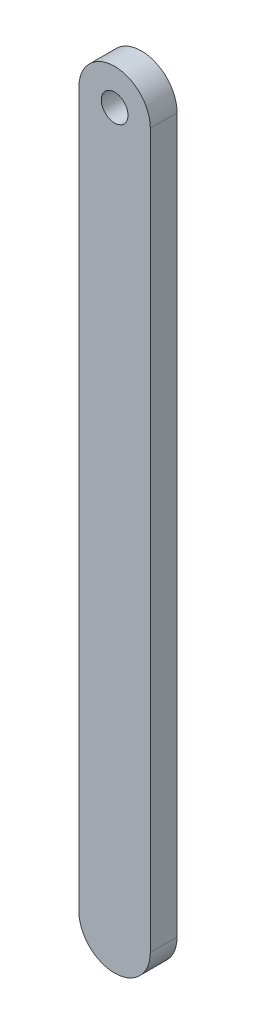
ISO-10303-21;
HEADER;
FILE_DESCRIPTION(('STEP AP214'),'2;1');
FILE_NAME('part.step','',(''),(''),'','','');
FILE_SCHEMA(('AUTOMOTIVE_DESIGN { 1 0 10303 214 1 1 1 1 }'));
ENDSEC;
DATA;
#1=APPLICATION_CONTEXT('core data for automotive mechanical design processes');
#2=APPLICATION_PROTOCOL_DEFINITION('international standard','automotive_design',2000,#1);
#3=PRODUCT_CONTEXT('',#1,'mechanical');
#4=PRODUCT('Part','Part','',(#3));
#5=PRODUCT_RELATED_PRODUCT_CATEGORY('part','',(#4));
#6=PRODUCT_DEFINITION_FORMATION('','',#4);
#7=PRODUCT_DEFINITION_CONTEXT('part definition',#1,'design');
#8=PRODUCT_DEFINITION('design','',#6,#7);
#9=PRODUCT_DEFINITION_SHAPE('','',#8);
#10=(LENGTH_UNIT() NAMED_UNIT(*) SI_UNIT(.MILLI.,.METRE.));
#11=(NAMED_UNIT(*) PLANE_ANGLE_UNIT() SI_UNIT($,.RADIAN.));
#12=(NAMED_UNIT(*) SI_UNIT($,.STERADIAN.) SOLID_ANGLE_UNIT());
#13=UNCERTAINTY_MEASURE_WITH_UNIT(LENGTH_MEASURE(1.E-05),#10,'distance_accuracy_value','');
#14=(GEOMETRIC_REPRESENTATION_CONTEXT(3) GLOBAL_UNCERTAINTY_ASSIGNED_CONTEXT((#13)) GLOBAL_UNIT_ASSIGNED_CONTEXT((#10,
#11,#12)) REPRESENTATION_CONTEXT('',''));
#15=CARTESIAN_POINT('',(0.,0.,0.));
#16=DIRECTION('',(0.,0.,1.));
#17=DIRECTION('',(1.,0.,0.));
#18=AXIS2_PLACEMENT_3D('',#15,#16,#17);
#19=CARTESIAN_POINT('',(2186.74024545616,1497.10013229052,3.));
#20=DIRECTION('',(0.,0.,1.));
#21=DIRECTION('',(1.,0.,0.));
#22=AXIS2_PLACEMENT_3D('',#19,#20,#21);
#23=PLANE('',#22);
#24=DIRECTION('',(0.,-1.,0.));
#25=VECTOR('',#24,1.);
#26=CARTESIAN_POINT('',(2182.74034545616,1561.71130395543,3.));
#27=LINE('',#26,#25);
#28=CARTESIAN_POINT('',(2182.74034545616,1577.10028841102,3.));
#29=VERTEX_POINT('',#28);
#30=CARTESIAN_POINT('',(2182.74034545616,1497.10018841039,3.));
#31=VERTEX_POINT('',#30);
#32=EDGE_CURVE('E109',#29,#31,#27,.T.);
#33=ORIENTED_EDGE('',*,*,#32,.T.);
#34=CARTESIAN_POINT('',(2186.74024545616,1497.10013229052,3.));
#35=DIRECTION('',(0.,0.,1.));
#36=DIRECTION('',(1.,0.,0.));
#37=AXIS2_PLACEMENT_3D('',#34,#35,#36);
#38=CIRCLE('',#37,3.99990000039386);
#39=CARTESIAN_POINT('',(2190.74014545616,1497.10018841037,3.));
#40=VERTEX_POINT('',#39);
#41=EDGE_CURVE('E138',#31,#40,#38,.T.);
#42=ORIENTED_EDGE('',*,*,#41,.T.);
#43=DIRECTION('',(3.22691094728856E-11,-1.,0.));
#44=VECTOR('',#43,1.);
#45=CARTESIAN_POINT('',(2190.74014545556,1515.62391237493,3.));
#46=LINE('',#45,#44);
#47=CARTESIAN_POINT('',(2190.74014545616,1577.10008841039,3.));
#48=VERTEX_POINT('',#47);
#49=EDGE_CURVE('E142',#48,#40,#46,.T.);
#50=ORIENTED_EDGE('',*,*,#49,.F.);
#51=CARTESIAN_POINT('',(2186.74024545616,1577.10018841071,3.));
#52=DIRECTION('',(0.,0.,1.));
#53=DIRECTION('',(1.,0.,0.));
#54=AXIS2_PLACEMENT_3D('',#51,#52,#53);
#55=CIRCLE('',#54,3.99990000125021);
#56=EDGE_CURVE('E151',#48,#29,#55,.T.);
#57=ORIENTED_EDGE('',*,*,#56,.T.);
#58=EDGE_LOOP('',(#33,#42,#50,#57));
#59=FACE_BOUND('',#58,.T.);
#60=CARTESIAN_POINT('',(2186.74034545455,1577.10018840878,3.));
#61=DIRECTION('',(0.,0.,1.));
#62=DIRECTION('',(1.,0.,0.));
#63=AXIS2_PLACEMENT_3D('',#60,#61,#62);
#64=CIRCLE('',#63,1.50000000000011);
#65=CARTESIAN_POINT('',(2188.24034545455,1577.10018840878,3.));
#66=VERTEX_POINT('',#65);
#67=EDGE_CURVE('E159',#66,#66,#64,.T.);
#68=ORIENTED_EDGE('',*,*,#67,.F.);
#69=EDGE_LOOP('',(#68));
#70=FACE_BOUND('',#69,.T.);
#71=ADVANCED_FACE('F92',(#59,#70),#23,.T.);
#72=CARTESIAN_POINT('',(2186.74024545616,1497.10013229052,0.));
#73=DIRECTION('',(0.,0.,1.));
#74=DIRECTION('',(1.,0.,0.));
#75=AXIS2_PLACEMENT_3D('',#72,#73,#74);
#76=PLANE('',#75);
#77=CARTESIAN_POINT('',(2186.74024545616,1497.10013229052,0.));
#78=DIRECTION('',(0.,0.,1.));
#79=DIRECTION('',(1.,0.,0.));
#80=AXIS2_PLACEMENT_3D('',#77,#78,#79);
#81=CIRCLE('',#80,3.99990000039386);
#82=CARTESIAN_POINT('',(2182.74034545616,1497.10018841039,0.));
#83=VERTEX_POINT('',#82);
#84=CARTESIAN_POINT('',(2190.74014545616,1497.10018841037,0.));
#85=VERTEX_POINT('',#84);
#86=EDGE_CURVE('E147',#83,#85,#81,.T.);
#87=ORIENTED_EDGE('',*,*,#86,.F.);
#88=DIRECTION('',(0.,1.,0.));
#89=VECTOR('',#88,1.);
#90=CARTESIAN_POINT('',(2182.74034545616,1561.71130395543,0.));
#91=LINE('',#90,#89);
#92=CARTESIAN_POINT('',(2182.74034545616,1577.10028841102,0.));
#93=VERTEX_POINT('',#92);
#94=EDGE_CURVE('E133',#83,#93,#91,.T.);
#95=ORIENTED_EDGE('',*,*,#94,.T.);
#96=CARTESIAN_POINT('',(2186.74024545616,1577.10018841071,0.));
#97=DIRECTION('',(0.,0.,1.));
#98=DIRECTION('',(1.,0.,0.));
#99=AXIS2_PLACEMENT_3D('',#96,#97,#98);
#100=CIRCLE('',#99,3.99990000125021);
#101=CARTESIAN_POINT('',(2190.74014545616,1577.10008841039,0.));
#102=VERTEX_POINT('',#101);
#103=EDGE_CURVE('E161',#102,#93,#100,.T.);
#104=ORIENTED_EDGE('',*,*,#103,.F.);
#105=DIRECTION('',(2.22954618024291E-10,-1.,0.));
#106=VECTOR('',#105,1.);
#107=CARTESIAN_POINT('',(2190.74014545616,1577.10008841039,0.));
#108=LINE('',#107,#106);
#109=EDGE_CURVE('E158',#102,#85,#108,.T.);
#110=ORIENTED_EDGE('',*,*,#109,.T.);
#111=EDGE_LOOP('',(#87,#95,#104,#110));
#112=FACE_BOUND('',#111,.T.);
#113=CARTESIAN_POINT('',(2186.74034545455,1577.10018840878,0.));
#114=DIRECTION('',(0.,0.,1.));
#115=DIRECTION('',(1.,0.,0.));
#116=AXIS2_PLACEMENT_3D('',#113,#114,#115);
#117=CIRCLE('',#116,1.50000000000011);
#118=CARTESIAN_POINT('',(2188.24034545455,1577.10018840878,0.));
#119=VERTEX_POINT('',#118);
#120=EDGE_CURVE('E174',#119,#119,#117,.T.);
#121=ORIENTED_EDGE('',*,*,#120,.T.);
#122=EDGE_LOOP('',(#121));
#123=FACE_BOUND('',#122,.T.);
#124=ADVANCED_FACE('F168',(#112,#123),#76,.F.);
#125=CARTESIAN_POINT('',(2186.74024545616,1497.10013229052,3.));
#126=DIRECTION('',(0.,0.,-1.));
#127=DIRECTION('',(-1.,0.,0.));
#128=AXIS2_PLACEMENT_3D('',#125,#126,#127);
#129=CYLINDRICAL_SURFACE('',#128,3.99990000039386);
#130=ORIENTED_EDGE('',*,*,#86,.T.);
#131=DIRECTION('',(0.,0.,-1.));
#132=VECTOR('',#131,1.);
#133=CARTESIAN_POINT('',(2190.74014545616,1497.10018841037,3.));
#134=LINE('',#133,#132);
#135=EDGE_CURVE('E101',#40,#85,#134,.T.);
#136=ORIENTED_EDGE('',*,*,#135,.F.);
#137=ORIENTED_EDGE('',*,*,#41,.F.);
#138=DIRECTION('',(0.,0.,-1.));
#139=VECTOR('',#138,1.);
#140=CARTESIAN_POINT('',(2182.74034545616,1497.10018841039,3.));
#141=LINE('',#140,#139);
#142=EDGE_CURVE('E12',#31,#83,#141,.T.);
#143=ORIENTED_EDGE('',*,*,#142,.T.);
#144=EDGE_LOOP('',(#130,#136,#137,#143));
#145=FACE_BOUND('',#144,.T.);
#146=ADVANCED_FACE('F94',(#145),#129,.T.);
#147=CARTESIAN_POINT('',(2190.74014545616,1577.10008841039,3.));
#148=DIRECTION('',(1.,2.22954618024291E-10,0.));
#149=DIRECTION('',(-2.22954618024291E-10,1.,0.));
#150=AXIS2_PLACEMENT_3D('',#147,#148,#149);
#151=PLANE('',#150);
#152=ORIENTED_EDGE('',*,*,#109,.F.);
#153=DIRECTION('',(0.,0.,-1.));
#154=VECTOR('',#153,1.);
#155=CARTESIAN_POINT('',(2190.74014545616,1577.10008841039,3.));
#156=LINE('',#155,#154);
#157=EDGE_CURVE('E127',#48,#102,#156,.T.);
#158=ORIENTED_EDGE('',*,*,#157,.F.);
#159=ORIENTED_EDGE('',*,*,#49,.T.);
#160=ORIENTED_EDGE('',*,*,#135,.T.);
#161=EDGE_LOOP('',(#152,#158,#159,#160));
#162=FACE_BOUND('',#161,.T.);
#163=ADVANCED_FACE('F150',(#162),#151,.T.);
#164=CARTESIAN_POINT('',(2186.74024545616,1577.10018841071,3.));
#165=DIRECTION('',(0.,0.,-1.));
#166=DIRECTION('',(-1.,0.,0.));
#167=AXIS2_PLACEMENT_3D('',#164,#165,#166);
#168=CYLINDRICAL_SURFACE('',#167,3.99990000125021);
#169=ORIENTED_EDGE('',*,*,#103,.T.);
#170=DIRECTION('',(0.,0.,-1.));
#171=VECTOR('',#170,1.);
#172=CARTESIAN_POINT('',(2182.74034545616,1577.10028841102,3.));
#173=LINE('',#172,#171);
#174=EDGE_CURVE('E153',#29,#93,#173,.T.);
#175=ORIENTED_EDGE('',*,*,#174,.F.);
#176=ORIENTED_EDGE('',*,*,#56,.F.);
#177=ORIENTED_EDGE('',*,*,#157,.T.);
#178=EDGE_LOOP('',(#169,#175,#176,#177));
#179=FACE_BOUND('',#178,.T.);
#180=ADVANCED_FACE('F167',(#179),#168,.T.);
#181=CARTESIAN_POINT('',(2182.74034545616,1561.71130395543,3.));
#182=DIRECTION('',(-1.,0.,0.));
#183=DIRECTION('',(0.,0.,1.));
#184=AXIS2_PLACEMENT_3D('',#181,#182,#183);
#185=PLANE('',#184);
#186=ORIENTED_EDGE('',*,*,#94,.F.);
#187=ORIENTED_EDGE('',*,*,#142,.F.);
#188=ORIENTED_EDGE('',*,*,#32,.F.);
#189=ORIENTED_EDGE('',*,*,#174,.T.);
#190=EDGE_LOOP('',(#186,#187,#188,#189));
#191=FACE_BOUND('',#190,.T.);
#192=ADVANCED_FACE('F166',(#191),#185,.T.);
#193=CARTESIAN_POINT('',(2186.74034545455,1577.10018840878,3.));
#194=DIRECTION('',(0.,0.,-1.));
#195=DIRECTION('',(-1.,0.,0.));
#196=AXIS2_PLACEMENT_3D('',#193,#194,#195);
#197=CYLINDRICAL_SURFACE('',#196,1.50000000000011);
#198=ORIENTED_EDGE('',*,*,#67,.T.);
#199=EDGE_LOOP('',(#198));
#200=FACE_BOUND('',#199,.T.);
#201=ORIENTED_EDGE('',*,*,#120,.F.);
#202=EDGE_LOOP('',(#201));
#203=FACE_BOUND('',#202,.T.);
#204=ADVANCED_FACE('F181',(#200,#203),#197,.F.);
#205=CLOSED_SHELL('',(#71,#124,#146,#163,#180,#192,#204));
#206=MANIFOLD_SOLID_BREP('B2',#205);
#207=ADVANCED_BREP_SHAPE_REPRESENTATION('',(#18,#206),#14);
#208=SHAPE_DEFINITION_REPRESENTATION(#9,#207);
ENDSEC;
END-ISO-10303-21;
